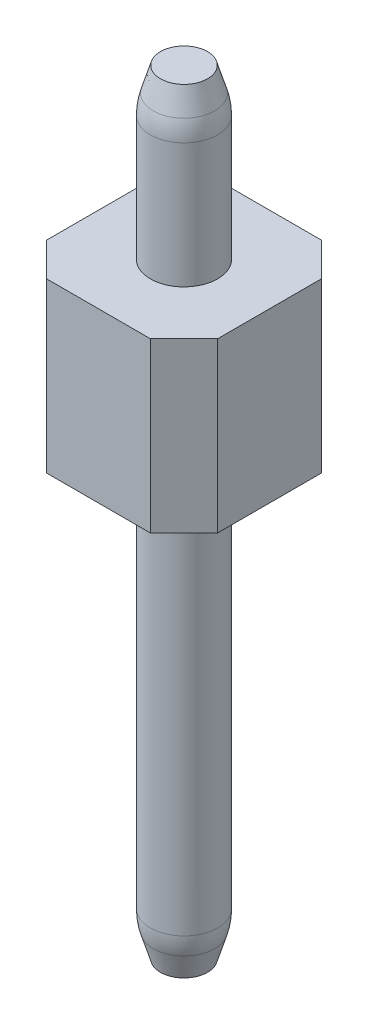
ISO-10303-21;
HEADER;
FILE_DESCRIPTION(('STEP AP214'),'2;1');
FILE_NAME('part.step','',(''),(''),'','','');
FILE_SCHEMA(('AUTOMOTIVE_DESIGN { 1 0 10303 214 1 1 1 1 }'));
ENDSEC;
DATA;
#1=APPLICATION_CONTEXT('core data for automotive mechanical design processes');
#2=APPLICATION_PROTOCOL_DEFINITION('international standard','automotive_design',2000,#1);
#3=PRODUCT_CONTEXT('',#1,'mechanical');
#4=PRODUCT('Part','Part','',(#3));
#5=PRODUCT_RELATED_PRODUCT_CATEGORY('part','',(#4));
#6=PRODUCT_DEFINITION_FORMATION('','',#4);
#7=PRODUCT_DEFINITION_CONTEXT('part definition',#1,'design');
#8=PRODUCT_DEFINITION('design','',#6,#7);
#9=PRODUCT_DEFINITION_SHAPE('','',#8);
#10=(LENGTH_UNIT() NAMED_UNIT(*) SI_UNIT(.MILLI.,.METRE.));
#11=(NAMED_UNIT(*) PLANE_ANGLE_UNIT() SI_UNIT($,.RADIAN.));
#12=(NAMED_UNIT(*) SI_UNIT($,.STERADIAN.) SOLID_ANGLE_UNIT());
#13=UNCERTAINTY_MEASURE_WITH_UNIT(LENGTH_MEASURE(1.E-05),#10,'distance_accuracy_value','');
#14=(GEOMETRIC_REPRESENTATION_CONTEXT(3) GLOBAL_UNCERTAINTY_ASSIGNED_CONTEXT((#13)) GLOBAL_UNIT_ASSIGNED_CONTEXT((#10,
#11,#12)) REPRESENTATION_CONTEXT('',''));
#15=CARTESIAN_POINT('',(0.,0.,0.));
#16=DIRECTION('',(0.,0.,1.));
#17=DIRECTION('',(1.,0.,0.));
#18=AXIS2_PLACEMENT_3D('',#15,#16,#17);
#19=CARTESIAN_POINT('',(0.,11.5,0.));
#20=DIRECTION('',(0.,-1.,0.));
#21=DIRECTION('',(0.,0.,-1.));
#22=AXIS2_PLACEMENT_3D('',#19,#20,#21);
#23=CYLINDRICAL_SURFACE('',#22,0.5);
#24=CARTESIAN_POINT('',(0.,10.8532311636965,0.));
#25=DIRECTION('',(0.,1.,0.));
#26=DIRECTION('',(0.,0.,1.));
#27=AXIS2_PLACEMENT_3D('',#24,#25,#26);
#28=CIRCLE('',#27,0.5);
#29=CARTESIAN_POINT('',(0.,10.8532311636965,0.5));
#30=VERTEX_POINT('',#29);
#31=EDGE_CURVE('E167',#30,#30,#28,.F.);
#32=ORIENTED_EDGE('',*,*,#31,.T.);
#33=EDGE_LOOP('',(#32));
#34=FACE_BOUND('',#33,.T.);
#35=CARTESIAN_POINT('',(0.,9.,0.));
#36=DIRECTION('',(0.,-1.,0.));
#37=DIRECTION('',(0.,0.,-1.));
#38=AXIS2_PLACEMENT_3D('',#35,#36,#37);
#39=CIRCLE('',#38,0.5);
#40=CARTESIAN_POINT('',(0.,9.,-0.5));
#41=VERTEX_POINT('',#40);
#42=EDGE_CURVE('E161',#41,#41,#39,.T.);
#43=ORIENTED_EDGE('',*,*,#42,.F.);
#44=EDGE_LOOP('',(#43));
#45=FACE_BOUND('',#44,.T.);
#46=ADVANCED_FACE('F36',(#34,#45),#23,.T.);
#47=CARTESIAN_POINT('',(0.,11.5,0.));
#48=DIRECTION('',(0.,1.,0.));
#49=DIRECTION('',(0.,0.,1.));
#50=AXIS2_PLACEMENT_3D('',#47,#48,#49);
#51=PLANE('',#50);
#52=CARTESIAN_POINT('',(0.,11.5,0.));
#53=DIRECTION('',(0.,1.,0.));
#54=DIRECTION('',(0.,0.,1.));
#55=AXIS2_PLACEMENT_3D('',#52,#53,#54);
#56=CIRCLE('',#55,0.350000000000005);
#57=CARTESIAN_POINT('',(0.,11.5,0.350000000000005));
#58=VERTEX_POINT('',#57);
#59=EDGE_CURVE('E164',#58,#58,#56,.T.);
#60=ORIENTED_EDGE('',*,*,#59,.T.);
#61=EDGE_LOOP('',(#60));
#62=FACE_BOUND('',#61,.T.);
#63=ADVANCED_FACE('F213',(#62),#51,.T.);
#64=CARTESIAN_POINT('',(-1.27,9.,0.77));
#65=DIRECTION('',(1.,0.,0.));
#66=DIRECTION('',(0.,0.,-1.));
#67=AXIS2_PLACEMENT_3D('',#64,#65,#66);
#68=PLANE('',#67);
#69=DIRECTION('',(0.,0.,1.));
#70=VECTOR('',#69,1.);
#71=CARTESIAN_POINT('',(-1.27,6.5,0.77));
#72=LINE('',#71,#70);
#73=CARTESIAN_POINT('',(-1.27,6.5,-0.77));
#74=VERTEX_POINT('',#73);
#75=CARTESIAN_POINT('',(-1.27,6.5,0.77));
#76=VERTEX_POINT('',#75);
#77=EDGE_CURVE('E131',#74,#76,#72,.T.);
#78=ORIENTED_EDGE('',*,*,#77,.T.);
#79=DIRECTION('',(0.,-1.,0.));
#80=VECTOR('',#79,1.);
#81=CARTESIAN_POINT('',(-1.27,9.,0.77));
#82=LINE('',#81,#80);
#83=CARTESIAN_POINT('',(-1.27,9.,0.77));
#84=VERTEX_POINT('',#83);
#85=EDGE_CURVE('E156',#84,#76,#82,.T.);
#86=ORIENTED_EDGE('',*,*,#85,.F.);
#87=DIRECTION('',(0.,0.,1.));
#88=VECTOR('',#87,1.);
#89=CARTESIAN_POINT('',(-1.27,9.,0.77));
#90=LINE('',#89,#88);
#91=CARTESIAN_POINT('',(-1.27,9.,-0.77));
#92=VERTEX_POINT('',#91);
#93=EDGE_CURVE('E144',#92,#84,#90,.T.);
#94=ORIENTED_EDGE('',*,*,#93,.F.);
#95=DIRECTION('',(0.,-1.,0.));
#96=VECTOR('',#95,1.);
#97=CARTESIAN_POINT('',(-1.27,9.,-0.77));
#98=LINE('',#97,#96);
#99=EDGE_CURVE('E127',#92,#74,#98,.T.);
#100=ORIENTED_EDGE('',*,*,#99,.T.);
#101=EDGE_LOOP('',(#78,#86,#94,#100));
#102=FACE_BOUND('',#101,.T.);
#103=ADVANCED_FACE('F218',(#102),#68,.F.);
#104=CARTESIAN_POINT('',(-1.27,9.,0.77));
#105=DIRECTION('',(0.707106781186548,0.,-0.707106781186548));
#106=DIRECTION('',(-0.707106781186548,0.,-0.707106781186548));
#107=AXIS2_PLACEMENT_3D('',#104,#105,#106);
#108=PLANE('',#107);
#109=DIRECTION('',(0.707106781186548,0.,0.707106781186548));
#110=VECTOR('',#109,1.);
#111=CARTESIAN_POINT('',(-1.27,6.5,0.77));
#112=LINE('',#111,#110);
#113=CARTESIAN_POINT('',(-0.77,6.5,1.27));
#114=VERTEX_POINT('',#113);
#115=EDGE_CURVE('E134',#76,#114,#112,.T.);
#116=ORIENTED_EDGE('',*,*,#115,.T.);
#117=DIRECTION('',(0.,-1.,0.));
#118=VECTOR('',#117,1.);
#119=CARTESIAN_POINT('',(-0.77,9.,1.27));
#120=LINE('',#119,#118);
#121=CARTESIAN_POINT('',(-0.77,9.,1.27));
#122=VERTEX_POINT('',#121);
#123=EDGE_CURVE('E153',#122,#114,#120,.T.);
#124=ORIENTED_EDGE('',*,*,#123,.F.);
#125=DIRECTION('',(0.707106781186548,0.,0.707106781186548));
#126=VECTOR('',#125,1.);
#127=CARTESIAN_POINT('',(-1.27,9.,0.77));
#128=LINE('',#127,#126);
#129=EDGE_CURVE('E95',#84,#122,#128,.T.);
#130=ORIENTED_EDGE('',*,*,#129,.F.);
#131=ORIENTED_EDGE('',*,*,#85,.T.);
#132=EDGE_LOOP('',(#116,#124,#130,#131));
#133=FACE_BOUND('',#132,.T.);
#134=ADVANCED_FACE('F291',(#133),#108,.F.);
#135=CARTESIAN_POINT('',(-0.77,9.,1.27));
#136=DIRECTION('',(0.,0.,-1.));
#137=DIRECTION('',(-1.,0.,0.));
#138=AXIS2_PLACEMENT_3D('',#135,#136,#137);
#139=PLANE('',#138);
#140=DIRECTION('',(1.,0.,0.));
#141=VECTOR('',#140,1.);
#142=CARTESIAN_POINT('',(-0.77,6.5,1.27));
#143=LINE('',#142,#141);
#144=CARTESIAN_POINT('',(0.77,6.5,1.27));
#145=VERTEX_POINT('',#144);
#146=EDGE_CURVE('E136',#114,#145,#143,.T.);
#147=ORIENTED_EDGE('',*,*,#146,.T.);
#148=DIRECTION('',(0.,-1.,0.));
#149=VECTOR('',#148,1.);
#150=CARTESIAN_POINT('',(0.77,9.,1.27));
#151=LINE('',#150,#149);
#152=CARTESIAN_POINT('',(0.77,9.,1.27));
#153=VERTEX_POINT('',#152);
#154=EDGE_CURVE('E150',#153,#145,#151,.T.);
#155=ORIENTED_EDGE('',*,*,#154,.F.);
#156=DIRECTION('',(1.,0.,0.));
#157=VECTOR('',#156,1.);
#158=CARTESIAN_POINT('',(-0.77,9.,1.27));
#159=LINE('',#158,#157);
#160=EDGE_CURVE('E365',#122,#153,#159,.T.);
#161=ORIENTED_EDGE('',*,*,#160,.F.);
#162=ORIENTED_EDGE('',*,*,#123,.T.);
#163=EDGE_LOOP('',(#147,#155,#161,#162));
#164=FACE_BOUND('',#163,.T.);
#165=ADVANCED_FACE('F280',(#164),#139,.F.);
#166=CARTESIAN_POINT('',(0.77,9.,1.27));
#167=DIRECTION('',(-0.707106781186548,0.,-0.707106781186548));
#168=DIRECTION('',(-0.707106781186548,0.,0.707106781186548));
#169=AXIS2_PLACEMENT_3D('',#166,#167,#168);
#170=PLANE('',#169);
#171=DIRECTION('',(0.707106781186548,0.,-0.707106781186548));
#172=VECTOR('',#171,1.);
#173=CARTESIAN_POINT('',(0.77,6.5,1.27));
#174=LINE('',#173,#172);
#175=CARTESIAN_POINT('',(1.27,6.5,0.77));
#176=VERTEX_POINT('',#175);
#177=EDGE_CURVE('E138',#145,#176,#174,.T.);
#178=ORIENTED_EDGE('',*,*,#177,.T.);
#179=DIRECTION('',(0.,-1.,0.));
#180=VECTOR('',#179,1.);
#181=CARTESIAN_POINT('',(1.27,9.,0.77));
#182=LINE('',#181,#180);
#183=CARTESIAN_POINT('',(1.27,9.,0.77));
#184=VERTEX_POINT('',#183);
#185=EDGE_CURVE('E148',#184,#176,#182,.T.);
#186=ORIENTED_EDGE('',*,*,#185,.F.);
#187=DIRECTION('',(0.707106781186548,0.,-0.707106781186548));
#188=VECTOR('',#187,1.);
#189=CARTESIAN_POINT('',(0.77,9.,1.27));
#190=LINE('',#189,#188);
#191=EDGE_CURVE('E116',#153,#184,#190,.T.);
#192=ORIENTED_EDGE('',*,*,#191,.F.);
#193=ORIENTED_EDGE('',*,*,#154,.T.);
#194=EDGE_LOOP('',(#178,#186,#192,#193));
#195=FACE_BOUND('',#194,.T.);
#196=ADVANCED_FACE('F270',(#195),#170,.F.);
#197=CARTESIAN_POINT('',(0.77,9.,-1.27));
#198=DIRECTION('',(-0.707106781186548,0.,0.707106781186548));
#199=DIRECTION('',(0.707106781186548,0.,0.707106781186548));
#200=AXIS2_PLACEMENT_3D('',#197,#198,#199);
#201=PLANE('',#200);
#202=DIRECTION('',(-0.707106781186548,0.,-0.707106781186548));
#203=VECTOR('',#202,1.);
#204=CARTESIAN_POINT('',(0.77,6.5,-1.27));
#205=LINE('',#204,#203);
#206=CARTESIAN_POINT('',(1.27,6.5,-0.77));
#207=VERTEX_POINT('',#206);
#208=CARTESIAN_POINT('',(0.77,6.5,-1.27));
#209=VERTEX_POINT('',#208);
#210=EDGE_CURVE('E121',#207,#209,#205,.T.);
#211=ORIENTED_EDGE('',*,*,#210,.T.);
#212=DIRECTION('',(0.,-1.,0.));
#213=VECTOR('',#212,1.);
#214=CARTESIAN_POINT('',(0.77,9.,-1.27));
#215=LINE('',#214,#213);
#216=CARTESIAN_POINT('',(0.77,9.,-1.27));
#217=VERTEX_POINT('',#216);
#218=EDGE_CURVE('E118',#217,#209,#215,.T.);
#219=ORIENTED_EDGE('',*,*,#218,.F.);
#220=DIRECTION('',(-0.707106781186548,0.,-0.707106781186548));
#221=VECTOR('',#220,1.);
#222=CARTESIAN_POINT('',(0.77,9.,-1.27));
#223=LINE('',#222,#221);
#224=CARTESIAN_POINT('',(1.27,9.,-0.77));
#225=VERTEX_POINT('',#224);
#226=EDGE_CURVE('E105',#225,#217,#223,.T.);
#227=ORIENTED_EDGE('',*,*,#226,.F.);
#228=DIRECTION('',(0.,-1.,0.));
#229=VECTOR('',#228,1.);
#230=CARTESIAN_POINT('',(1.27,9.,-0.77));
#231=LINE('',#230,#229);
#232=EDGE_CURVE('E122',#225,#207,#231,.T.);
#233=ORIENTED_EDGE('',*,*,#232,.T.);
#234=EDGE_LOOP('',(#211,#219,#227,#233));
#235=FACE_BOUND('',#234,.T.);
#236=ADVANCED_FACE('F119',(#235),#201,.F.);
#237=CARTESIAN_POINT('',(-0.77,9.,-1.27));
#238=DIRECTION('',(0.,0.,1.));
#239=DIRECTION('',(1.,0.,0.));
#240=AXIS2_PLACEMENT_3D('',#237,#238,#239);
#241=PLANE('',#240);
#242=DIRECTION('',(-1.,0.,0.));
#243=VECTOR('',#242,1.);
#244=CARTESIAN_POINT('',(-0.77,6.5,-1.27));
#245=LINE('',#244,#243);
#246=CARTESIAN_POINT('',(-0.77,6.5,-1.27));
#247=VERTEX_POINT('',#246);
#248=EDGE_CURVE('E80',#209,#247,#245,.T.);
#249=ORIENTED_EDGE('',*,*,#248,.T.);
#250=DIRECTION('',(0.,-1.,0.));
#251=VECTOR('',#250,1.);
#252=CARTESIAN_POINT('',(-0.77,9.,-1.27));
#253=LINE('',#252,#251);
#254=CARTESIAN_POINT('',(-0.77,9.,-1.27));
#255=VERTEX_POINT('',#254);
#256=EDGE_CURVE('E123',#255,#247,#253,.T.);
#257=ORIENTED_EDGE('',*,*,#256,.F.);
#258=DIRECTION('',(-1.,0.,0.));
#259=VECTOR('',#258,1.);
#260=CARTESIAN_POINT('',(-0.77,9.,-1.27));
#261=LINE('',#260,#259);
#262=EDGE_CURVE('E110',#217,#255,#261,.T.);
#263=ORIENTED_EDGE('',*,*,#262,.F.);
#264=ORIENTED_EDGE('',*,*,#218,.T.);
#265=EDGE_LOOP('',(#249,#257,#263,#264));
#266=FACE_BOUND('',#265,.T.);
#267=ADVANCED_FACE('F125',(#266),#241,.F.);
#268=CARTESIAN_POINT('',(-1.27,9.,-0.77));
#269=DIRECTION('',(0.707106781186548,0.,0.707106781186548));
#270=DIRECTION('',(0.707106781186548,0.,-0.707106781186548));
#271=AXIS2_PLACEMENT_3D('',#268,#269,#270);
#272=PLANE('',#271);
#273=DIRECTION('',(-0.707106781186548,0.,0.707106781186548));
#274=VECTOR('',#273,1.);
#275=CARTESIAN_POINT('',(-1.27,6.5,-0.77));
#276=LINE('',#275,#274);
#277=EDGE_CURVE('E86',#247,#74,#276,.T.);
#278=ORIENTED_EDGE('',*,*,#277,.T.);
#279=ORIENTED_EDGE('',*,*,#99,.F.);
#280=DIRECTION('',(-0.707106781186548,0.,0.707106781186548));
#281=VECTOR('',#280,1.);
#282=CARTESIAN_POINT('',(-1.27,9.,-0.77));
#283=LINE('',#282,#281);
#284=EDGE_CURVE('E53',#255,#92,#283,.T.);
#285=ORIENTED_EDGE('',*,*,#284,.F.);
#286=ORIENTED_EDGE('',*,*,#256,.T.);
#287=EDGE_LOOP('',(#278,#279,#285,#286));
#288=FACE_BOUND('',#287,.T.);
#289=ADVANCED_FACE('F207',(#288),#272,.F.);
#290=CARTESIAN_POINT('',(0.,9.,0.));
#291=DIRECTION('',(0.,-1.,0.));
#292=DIRECTION('',(0.,0.,-1.));
#293=AXIS2_PLACEMENT_3D('',#290,#291,#292);
#294=PLANE('',#293);
#295=ORIENTED_EDGE('',*,*,#42,.T.);
#296=EDGE_LOOP('',(#295));
#297=FACE_BOUND('',#296,.T.);
#298=ORIENTED_EDGE('',*,*,#191,.T.);
#299=DIRECTION('',(0.,0.,-1.));
#300=VECTOR('',#299,1.);
#301=CARTESIAN_POINT('',(1.27,9.,0.));
#302=LINE('',#301,#300);
#303=EDGE_CURVE('E113',#184,#225,#302,.T.);
#304=ORIENTED_EDGE('',*,*,#303,.T.);
#305=ORIENTED_EDGE('',*,*,#226,.T.);
#306=ORIENTED_EDGE('',*,*,#262,.T.);
#307=ORIENTED_EDGE('',*,*,#284,.T.);
#308=ORIENTED_EDGE('',*,*,#93,.T.);
#309=ORIENTED_EDGE('',*,*,#129,.T.);
#310=ORIENTED_EDGE('',*,*,#160,.T.);
#311=EDGE_LOOP('',(#298,#304,#305,#306,#307,#308,#309,#310));
#312=FACE_BOUND('',#311,.T.);
#313=ADVANCED_FACE('F108',(#297,#312),#294,.F.);
#314=CARTESIAN_POINT('',(0.,6.5,0.));
#315=DIRECTION('',(0.,-1.,0.));
#316=DIRECTION('',(0.,0.,-1.));
#317=AXIS2_PLACEMENT_3D('',#314,#315,#316);
#318=PLANE('',#317);
#319=DIRECTION('',(0.,0.,-1.));
#320=VECTOR('',#319,1.);
#321=CARTESIAN_POINT('',(1.27,6.5,0.));
#322=LINE('',#321,#320);
#323=EDGE_CURVE('E11',#176,#207,#322,.T.);
#324=ORIENTED_EDGE('',*,*,#323,.F.);
#325=ORIENTED_EDGE('',*,*,#177,.F.);
#326=ORIENTED_EDGE('',*,*,#146,.F.);
#327=ORIENTED_EDGE('',*,*,#115,.F.);
#328=ORIENTED_EDGE('',*,*,#77,.F.);
#329=ORIENTED_EDGE('',*,*,#277,.F.);
#330=ORIENTED_EDGE('',*,*,#248,.F.);
#331=ORIENTED_EDGE('',*,*,#210,.F.);
#332=EDGE_LOOP('',(#324,#325,#326,#327,#328,#329,#330,#331));
#333=FACE_BOUND('',#332,.T.);
#334=CARTESIAN_POINT('',(0.,6.5,0.));
#335=DIRECTION('',(0.,-1.,0.));
#336=DIRECTION('',(0.,0.,-1.));
#337=AXIS2_PLACEMENT_3D('',#334,#335,#336);
#338=CIRCLE('',#337,0.5);
#339=CARTESIAN_POINT('',(0.,6.5,-0.5));
#340=VERTEX_POINT('',#339);
#341=EDGE_CURVE('E158',#340,#340,#338,.T.);
#342=ORIENTED_EDGE('',*,*,#341,.F.);
#343=EDGE_LOOP('',(#342));
#344=FACE_BOUND('',#343,.T.);
#345=ADVANCED_FACE('F197',(#333,#344),#318,.T.);
#346=CARTESIAN_POINT('',(0.,0.,0.));
#347=DIRECTION('',(0.,1.,0.));
#348=DIRECTION('',(0.,0.,1.));
#349=AXIS2_PLACEMENT_3D('',#346,#347,#348);
#350=PLANE('',#349);
#351=CARTESIAN_POINT('',(0.,0.,0.));
#352=DIRECTION('',(0.,1.,0.));
#353=DIRECTION('',(0.,0.,1.));
#354=AXIS2_PLACEMENT_3D('',#351,#352,#353);
#355=CIRCLE('',#354,0.349999999999994);
#356=CARTESIAN_POINT('',(0.,0.,0.349999999999994));
#357=VERTEX_POINT('',#356);
#358=EDGE_CURVE('E173',#357,#357,#355,.F.);
#359=ORIENTED_EDGE('',*,*,#358,.T.);
#360=EDGE_LOOP('',(#359));
#361=FACE_BOUND('',#360,.T.);
#362=ADVANCED_FACE('F193',(#361),#350,.F.);
#363=CARTESIAN_POINT('',(0.,0.646768836303538,0.));
#364=DIRECTION('',(0.,-1.,0.));
#365=DIRECTION('',(0.,0.,-1.));
#366=AXIS2_PLACEMENT_3D('',#363,#364,#365);
#367=CIRCLE('',#366,0.5);
#368=CARTESIAN_POINT('',(0.,0.646768836303538,-0.5));
#369=VERTEX_POINT('',#368);
#370=EDGE_CURVE('E176',#369,#369,#367,.F.);
#371=ORIENTED_EDGE('',*,*,#370,.T.);
#372=EDGE_LOOP('',(#371));
#373=FACE_BOUND('',#372,.T.);
#374=ORIENTED_EDGE('',*,*,#341,.T.);
#375=EDGE_LOOP('',(#374));
#376=FACE_BOUND('',#375,.T.);
#377=ADVANCED_FACE('F189',(#373,#376),#23,.T.);
#378=CARTESIAN_POINT('',(0.,11.5,0.));
#379=DIRECTION('',(0.,-1.,0.));
#380=DIRECTION('',(0.,0.,-1.));
#381=AXIS2_PLACEMENT_3D('',#378,#379,#380);
#382=CONICAL_SURFACE('',#381,0.350000000000005,0.291456794477864);
#383=CARTESIAN_POINT('',(0.,11.1405790492628,0.));
#384=DIRECTION('',(0.,-1.,0.));
#385=DIRECTION('',(0.,0.,-1.));
#386=AXIS2_PLACEMENT_3D('',#383,#384,#385);
#387=CIRCLE('',#386,0.457826285221153);
#388=CARTESIAN_POINT('',(0.,11.1405790492628,-0.457826285221153));
#389=VERTEX_POINT('',#388);
#390=EDGE_CURVE('E170',#389,#389,#387,.F.);
#391=ORIENTED_EDGE('',*,*,#390,.T.);
#392=EDGE_LOOP('',(#391));
#393=FACE_BOUND('',#392,.T.);
#394=ORIENTED_EDGE('',*,*,#59,.F.);
#395=EDGE_LOOP('',(#394));
#396=FACE_BOUND('',#395,.T.);
#397=ADVANCED_FACE('F192',(#393,#396),#382,.T.);
#398=CARTESIAN_POINT('',(0.,10.8532311636965,0.));
#399=DIRECTION('',(0.,1.,0.));
#400=DIRECTION('',(0.,0.,1.));
#401=AXIS2_PLACEMENT_3D('',#398,#399,#400);
#402=DEGENERATE_TOROIDAL_SURFACE('',#401,0.5,1.,.F.);
#403=ORIENTED_EDGE('',*,*,#390,.F.);
#404=EDGE_LOOP('',(#403));
#405=FACE_BOUND('',#404,.T.);
#406=ORIENTED_EDGE('',*,*,#31,.F.);
#407=EDGE_LOOP('',(#406));
#408=FACE_BOUND('',#407,.T.);
#409=ADVANCED_FACE('F225',(#405,#408),#402,.F.);
#410=CARTESIAN_POINT('',(0.,0.500000000000021,0.));
#411=DIRECTION('',(0.,1.,0.));
#412=DIRECTION('',(0.,0.,1.));
#413=AXIS2_PLACEMENT_3D('',#410,#411,#412);
#414=CONICAL_SURFACE('',#413,0.5,0.291456794477866);
#415=CARTESIAN_POINT('',(0.,0.359420950737193,0.));
#416=DIRECTION('',(0.,1.,0.));
#417=DIRECTION('',(0.,0.,1.));
#418=AXIS2_PLACEMENT_3D('',#415,#416,#417);
#419=CIRCLE('',#418,0.457826285221152);
#420=CARTESIAN_POINT('',(0.,0.359420950737193,0.457826285221152));
#421=VERTEX_POINT('',#420);
#422=EDGE_CURVE('E45',#421,#421,#419,.F.);
#423=ORIENTED_EDGE('',*,*,#422,.T.);
#424=EDGE_LOOP('',(#423));
#425=FACE_BOUND('',#424,.T.);
#426=ORIENTED_EDGE('',*,*,#358,.F.);
#427=EDGE_LOOP('',(#426));
#428=FACE_BOUND('',#427,.T.);
#429=ADVANCED_FACE('F181',(#425,#428),#414,.T.);
#430=CARTESIAN_POINT('',(0.,0.646768836303538,0.));
#431=DIRECTION('',(0.,-1.,0.));
#432=DIRECTION('',(0.,0.,-1.));
#433=AXIS2_PLACEMENT_3D('',#430,#431,#432);
#434=DEGENERATE_TOROIDAL_SURFACE('',#433,0.5,1.,.F.);
#435=ORIENTED_EDGE('',*,*,#422,.F.);
#436=EDGE_LOOP('',(#435));
#437=FACE_BOUND('',#436,.T.);
#438=ORIENTED_EDGE('',*,*,#370,.F.);
#439=EDGE_LOOP('',(#438));
#440=FACE_BOUND('',#439,.T.);
#441=ADVANCED_FACE('F38',(#437,#440),#434,.F.);
#442=CARTESIAN_POINT('',(1.27,11.5,-1.27));
#443=DIRECTION('',(-1.,0.,0.));
#444=DIRECTION('',(0.,0.,1.));
#445=AXIS2_PLACEMENT_3D('',#442,#443,#444);
#446=PLANE('',#445);
#447=ORIENTED_EDGE('',*,*,#185,.T.);
#448=ORIENTED_EDGE('',*,*,#323,.T.);
#449=ORIENTED_EDGE('',*,*,#232,.F.);
#450=ORIENTED_EDGE('',*,*,#303,.F.);
#451=EDGE_LOOP('',(#447,#448,#449,#450));
#452=FACE_BOUND('',#451,.T.);
#453=ADVANCED_FACE('F186',(#452),#446,.F.);
#454=CLOSED_SHELL('',(#46,#63,#103,#134,#165,#196,#236,#267,#289,#313,#345,#362,#377,#397,#409,
#429,#441,#453));
#455=MANIFOLD_SOLID_BREP('B2',#454);
#456=ADVANCED_BREP_SHAPE_REPRESENTATION('',(#18,#455),#14);
#457=SHAPE_DEFINITION_REPRESENTATION(#9,#456);
ENDSEC;
END-ISO-10303-21;
